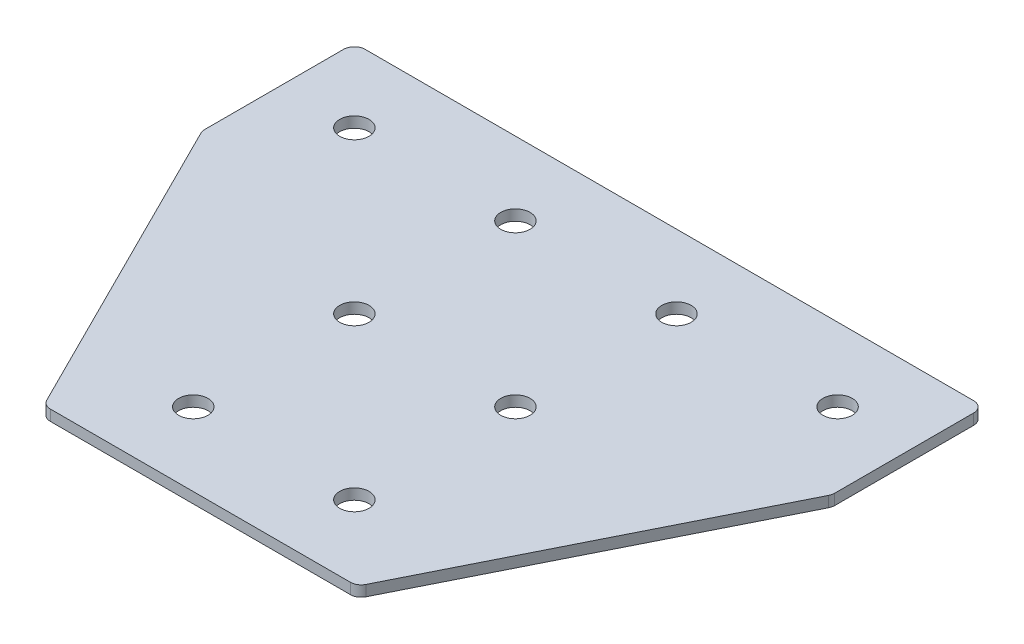
ISO-10303-21;
HEADER;
FILE_DESCRIPTION(('STEP AP214'),'2;1');
FILE_NAME('part.step','',(''),(''),'','','');
FILE_SCHEMA(('AUTOMOTIVE_DESIGN { 1 0 10303 214 1 1 1 1 }'));
ENDSEC;
DATA;
#1=APPLICATION_CONTEXT('core data for automotive mechanical design processes');
#2=APPLICATION_PROTOCOL_DEFINITION('international standard','automotive_design',2000,#1);
#3=PRODUCT_CONTEXT('',#1,'mechanical');
#4=PRODUCT('Part','Part','',(#3));
#5=PRODUCT_RELATED_PRODUCT_CATEGORY('part','',(#4));
#6=PRODUCT_DEFINITION_FORMATION('','',#4);
#7=PRODUCT_DEFINITION_CONTEXT('part definition',#1,'design');
#8=PRODUCT_DEFINITION('design','',#6,#7);
#9=PRODUCT_DEFINITION_SHAPE('','',#8);
#10=(LENGTH_UNIT() NAMED_UNIT(*) SI_UNIT(.MILLI.,.METRE.));
#11=(NAMED_UNIT(*) PLANE_ANGLE_UNIT() SI_UNIT($,.RADIAN.));
#12=(NAMED_UNIT(*) SI_UNIT($,.STERADIAN.) SOLID_ANGLE_UNIT());
#13=UNCERTAINTY_MEASURE_WITH_UNIT(LENGTH_MEASURE(1.E-05),#10,'distance_accuracy_value','');
#14=(GEOMETRIC_REPRESENTATION_CONTEXT(3) GLOBAL_UNCERTAINTY_ASSIGNED_CONTEXT((#13)) GLOBAL_UNIT_ASSIGNED_CONTEXT((#10,
#11,#12)) REPRESENTATION_CONTEXT('',''));
#15=CARTESIAN_POINT('',(0.,0.,0.));
#16=DIRECTION('',(0.,0.,1.));
#17=DIRECTION('',(1.,0.,0.));
#18=AXIS2_PLACEMENT_3D('',#15,#16,#17);
#19=CARTESIAN_POINT('',(-1.83641653643463,2.72446017824996,-47.3873571043964));
#20=DIRECTION('',(0.,-1.,0.));
#21=DIRECTION('',(0.,0.,-1.));
#22=AXIS2_PLACEMENT_3D('',#19,#20,#21);
#23=PLANE('',#22);
#24=DIRECTION('',(1.,0.,0.));
#25=VECTOR('',#24,1.);
#26=CARTESIAN_POINT('',(-44.8364165364347,2.72446017824996,63.1126428956036));
#27=LINE('',#26,#25);
#28=CARTESIAN_POINT('',(-43.7462465926852,2.72446017824996,63.1126428956036));
#29=VERTEX_POINT('',#28);
#30=CARTESIAN_POINT('',(40.073413519816,2.72446017824996,63.1126428956036));
#31=VERTEX_POINT('',#30);
#32=EDGE_CURVE('E194',#29,#31,#27,.T.);
#33=ORIENTED_EDGE('',*,*,#32,.F.);
#34=CARTESIAN_POINT('',(-43.7462465926852,2.72446017824996,60.1126428956036));
#35=DIRECTION('',(0.,1.,0.));
#36=DIRECTION('',(0.,0.,-1.));
#37=AXIS2_PLACEMENT_3D('',#34,#35,#36);
#38=CIRCLE('',#37,3.);
#39=CARTESIAN_POINT('',(-46.429528165685,2.72446017824996,61.4542836821035));
#40=VERTEX_POINT('',#39);
#41=EDGE_CURVE('E154',#40,#29,#38,.T.);
#42=ORIENTED_EDGE('',*,*,#41,.F.);
#43=DIRECTION('',(-0.447213595499957,0.,-0.894427190999917));
#44=VECTOR('',#43,1.);
#45=CARTESIAN_POINT('',(-45.6003485589349,2.72446017824996,63.1126428956036));
#46=LINE('',#45,#44);
#47=CARTESIAN_POINT('',(-89.5196981094343,2.72446017824996,-24.7260562053954));
#48=VERTEX_POINT('',#47);
#49=EDGE_CURVE('E141',#40,#48,#46,.T.);
#50=ORIENTED_EDGE('',*,*,#49,.T.);
#51=CARTESIAN_POINT('',(-86.8364165364345,2.72446017824996,-26.0676969918953));
#52=DIRECTION('',(0.,1.,0.));
#53=DIRECTION('',(0.,0.,-1.));
#54=AXIS2_PLACEMENT_3D('',#51,#52,#53);
#55=CIRCLE('',#54,3.);
#56=CARTESIAN_POINT('',(-89.8364165364345,2.72446017824996,-26.0676969918953));
#57=VERTEX_POINT('',#56);
#58=EDGE_CURVE('E152',#57,#48,#55,.T.);
#59=ORIENTED_EDGE('',*,*,#58,.F.);
#60=DIRECTION('',(0.,0.,-1.));
#61=VECTOR('',#60,1.);
#62=CARTESIAN_POINT('',(-89.8364165364345,2.72446017824996,-25.3594930593959));
#63=LINE('',#62,#61);
#64=CARTESIAN_POINT('',(-89.8364165364345,2.72446017824996,-64.8873571043964));
#65=VERTEX_POINT('',#64);
#66=EDGE_CURVE('E124',#57,#65,#63,.T.);
#67=ORIENTED_EDGE('',*,*,#66,.T.);
#68=CARTESIAN_POINT('',(-86.8364165364345,2.72446017824996,-64.8873571043964));
#69=DIRECTION('',(0.,1.,0.));
#70=DIRECTION('',(0.,0.,-1.));
#71=AXIS2_PLACEMENT_3D('',#68,#69,#70);
#72=CIRCLE('',#71,3.);
#73=CARTESIAN_POINT('',(-86.8364165364345,2.72446017824996,-67.8873571043964));
#74=VERTEX_POINT('',#73);
#75=EDGE_CURVE('E149',#74,#65,#72,.T.);
#76=ORIENTED_EDGE('',*,*,#75,.F.);
#77=DIRECTION('',(-1.,0.,0.));
#78=VECTOR('',#77,1.);
#79=CARTESIAN_POINT('',(86.1635834635653,2.72446017824996,-67.8873571043964));
#80=LINE('',#79,#78);
#81=CARTESIAN_POINT('',(83.1635834635653,2.72446017824996,-67.8873571043964));
#82=VERTEX_POINT('',#81);
#83=EDGE_CURVE('E191',#82,#74,#80,.T.);
#84=ORIENTED_EDGE('',*,*,#83,.F.);
#85=CARTESIAN_POINT('',(83.1635834635653,2.72446017824996,-64.8873571043964));
#86=DIRECTION('',(0.,-1.,0.));
#87=DIRECTION('',(0.,0.,-1.));
#88=AXIS2_PLACEMENT_3D('',#85,#86,#87);
#89=CIRCLE('',#88,3.);
#90=CARTESIAN_POINT('',(86.1635834635653,2.72446017824996,-64.8873571043964));
#91=VERTEX_POINT('',#90);
#92=EDGE_CURVE('E215',#82,#91,#89,.T.);
#93=ORIENTED_EDGE('',*,*,#92,.T.);
#94=DIRECTION('',(0.,0.,-1.));
#95=VECTOR('',#94,1.);
#96=CARTESIAN_POINT('',(86.1635834635653,2.72446017824996,-25.3594930593959));
#97=LINE('',#96,#95);
#98=CARTESIAN_POINT('',(86.1635834635653,2.72446017824996,-26.0676969918953));
#99=VERTEX_POINT('',#98);
#100=EDGE_CURVE('E188',#99,#91,#97,.T.);
#101=ORIENTED_EDGE('',*,*,#100,.F.);
#102=CARTESIAN_POINT('',(83.1635834635653,2.72446017824996,-26.0676969918953));
#103=DIRECTION('',(0.,-1.,0.));
#104=DIRECTION('',(0.,0.,-1.));
#105=AXIS2_PLACEMENT_3D('',#102,#103,#104);
#106=CIRCLE('',#105,3.);
#107=CARTESIAN_POINT('',(85.846865036565,2.72446017824996,-24.7260562053954));
#108=VERTEX_POINT('',#107);
#109=EDGE_CURVE('E31',#99,#108,#106,.T.);
#110=ORIENTED_EDGE('',*,*,#109,.T.);
#111=DIRECTION('',(0.447213595499957,0.,-0.894427190999917));
#112=VECTOR('',#111,1.);
#113=CARTESIAN_POINT('',(41.9275154860657,2.72446017824996,63.1126428956036));
#114=LINE('',#113,#112);
#115=CARTESIAN_POINT('',(42.7566950928157,2.72446017824996,61.4542836821035));
#116=VERTEX_POINT('',#115);
#117=EDGE_CURVE('E196',#116,#108,#114,.T.);
#118=ORIENTED_EDGE('',*,*,#117,.F.);
#119=CARTESIAN_POINT('',(40.073413519816,2.72446017824996,60.1126428956036));
#120=DIRECTION('',(0.,-1.,0.));
#121=DIRECTION('',(0.,0.,-1.));
#122=AXIS2_PLACEMENT_3D('',#119,#120,#121);
#123=CIRCLE('',#122,3.);
#124=EDGE_CURVE('E218',#116,#31,#123,.T.);
#125=ORIENTED_EDGE('',*,*,#124,.T.);
#126=EDGE_LOOP('',(#33,#42,#50,#59,#67,#76,#84,#93,#101,#110,#118,#125));
#127=FACE_BOUND('',#126,.T.);
#128=CARTESIAN_POINT('',(20.6635834635654,2.72446017824996,42.6126428956036));
#129=DIRECTION('',(0.,1.,0.));
#130=DIRECTION('',(0.,0.,1.));
#131=AXIS2_PLACEMENT_3D('',#128,#129,#130);
#132=CIRCLE('',#131,4.1);
#133=CARTESIAN_POINT('',(20.6635834635654,2.72446017824996,46.7126428956036));
#134=VERTEX_POINT('',#133);
#135=EDGE_CURVE('E164',#134,#134,#132,.T.);
#136=ORIENTED_EDGE('',*,*,#135,.T.);
#137=EDGE_LOOP('',(#136));
#138=FACE_BOUND('',#137,.T.);
#139=CARTESIAN_POINT('',(20.6635834635654,2.72446017824996,-2.38735710439639));
#140=DIRECTION('',(0.,1.,0.));
#141=DIRECTION('',(0.,0.,1.));
#142=AXIS2_PLACEMENT_3D('',#139,#140,#141);
#143=CIRCLE('',#142,4.1);
#144=CARTESIAN_POINT('',(20.6635834635654,2.72446017824996,1.71264289560361));
#145=VERTEX_POINT('',#144);
#146=EDGE_CURVE('E170',#145,#145,#143,.T.);
#147=ORIENTED_EDGE('',*,*,#146,.T.);
#148=EDGE_LOOP('',(#147));
#149=FACE_BOUND('',#148,.T.);
#150=CARTESIAN_POINT('',(65.6635834635654,2.72446017824996,-47.3873571043964));
#151=DIRECTION('',(0.,1.,0.));
#152=DIRECTION('',(0.,0.,1.));
#153=AXIS2_PLACEMENT_3D('',#150,#151,#152);
#154=CIRCLE('',#153,4.09999999999999);
#155=CARTESIAN_POINT('',(65.6635834635654,2.72446017824996,-43.2873571043964));
#156=VERTEX_POINT('',#155);
#157=EDGE_CURVE('E176',#156,#156,#154,.T.);
#158=ORIENTED_EDGE('',*,*,#157,.T.);
#159=EDGE_LOOP('',(#158));
#160=FACE_BOUND('',#159,.T.);
#161=CARTESIAN_POINT('',(20.6635834635654,2.72446017824996,-47.3873571043964));
#162=DIRECTION('',(0.,1.,0.));
#163=DIRECTION('',(0.,0.,1.));
#164=AXIS2_PLACEMENT_3D('',#161,#162,#163);
#165=CIRCLE('',#164,4.1);
#166=CARTESIAN_POINT('',(20.6635834635654,2.72446017824996,-43.2873571043964));
#167=VERTEX_POINT('',#166);
#168=EDGE_CURVE('E182',#167,#167,#165,.T.);
#169=ORIENTED_EDGE('',*,*,#168,.T.);
#170=EDGE_LOOP('',(#169));
#171=FACE_BOUND('',#170,.T.);
#172=CARTESIAN_POINT('',(-24.3364165364346,2.72446017824996,42.6126428956036));
#173=DIRECTION('',(0.,-1.,0.));
#174=DIRECTION('',(0.,0.,1.));
#175=AXIS2_PLACEMENT_3D('',#172,#173,#174);
#176=CIRCLE('',#175,4.1);
#177=CARTESIAN_POINT('',(-24.3364165364346,2.72446017824996,46.7126428956036));
#178=VERTEX_POINT('',#177);
#179=EDGE_CURVE('E270',#178,#178,#176,.T.);
#180=ORIENTED_EDGE('',*,*,#179,.F.);
#181=EDGE_LOOP('',(#180));
#182=FACE_BOUND('',#181,.T.);
#183=CARTESIAN_POINT('',(-24.3364165364346,2.72446017824996,-2.38735710439638));
#184=DIRECTION('',(0.,-1.,0.));
#185=DIRECTION('',(0.,0.,1.));
#186=AXIS2_PLACEMENT_3D('',#183,#184,#185);
#187=CIRCLE('',#186,4.1);
#188=CARTESIAN_POINT('',(-24.3364165364346,2.72446017824996,1.71264289560362));
#189=VERTEX_POINT('',#188);
#190=EDGE_CURVE('E264',#189,#189,#187,.T.);
#191=ORIENTED_EDGE('',*,*,#190,.F.);
#192=EDGE_LOOP('',(#191));
#193=FACE_BOUND('',#192,.T.);
#194=CARTESIAN_POINT('',(-69.3364165364346,2.72446017824996,-47.3873571043964));
#195=DIRECTION('',(0.,-1.,0.));
#196=DIRECTION('',(0.,0.,1.));
#197=AXIS2_PLACEMENT_3D('',#194,#195,#196);
#198=CIRCLE('',#197,4.09999999999999);
#199=CARTESIAN_POINT('',(-69.3364165364346,2.72446017824996,-43.2873571043964));
#200=VERTEX_POINT('',#199);
#201=EDGE_CURVE('E259',#200,#200,#198,.T.);
#202=ORIENTED_EDGE('',*,*,#201,.F.);
#203=EDGE_LOOP('',(#202));
#204=FACE_BOUND('',#203,.T.);
#205=CARTESIAN_POINT('',(-24.3364165364346,2.72446017824996,-47.3873571043964));
#206=DIRECTION('',(0.,-1.,0.));
#207=DIRECTION('',(0.,0.,1.));
#208=AXIS2_PLACEMENT_3D('',#205,#206,#207);
#209=CIRCLE('',#208,4.1);
#210=CARTESIAN_POINT('',(-24.3364165364346,2.72446017824996,-43.2873571043964));
#211=VERTEX_POINT('',#210);
#212=EDGE_CURVE('E134',#211,#211,#209,.T.);
#213=ORIENTED_EDGE('',*,*,#212,.F.);
#214=EDGE_LOOP('',(#213));
#215=FACE_BOUND('',#214,.T.);
#216=ADVANCED_FACE('F16',(#127,#138,#149,#160,#171,#182,#193,#204,#215),#23,.T.);
#217=CARTESIAN_POINT('',(86.1635834635653,2.72446017824996,-25.3594930593959));
#218=DIRECTION('',(1.,0.,0.));
#219=DIRECTION('',(0.,0.,-1.));
#220=AXIS2_PLACEMENT_3D('',#217,#218,#219);
#221=PLANE('',#220);
#222=DIRECTION('',(0.,0.,-1.));
#223=VECTOR('',#222,1.);
#224=CARTESIAN_POINT('',(86.1635834635653,5.72446017824996,-25.3594930593959));
#225=LINE('',#224,#223);
#226=CARTESIAN_POINT('',(86.1635834635653,5.72446017824996,-26.0676969918953));
#227=VERTEX_POINT('',#226);
#228=CARTESIAN_POINT('',(86.1635834635653,5.72446017824996,-64.8873571043964));
#229=VERTEX_POINT('',#228);
#230=EDGE_CURVE('E185',#227,#229,#225,.T.);
#231=ORIENTED_EDGE('',*,*,#230,.F.);
#232=DIRECTION('',(0.,1.,0.));
#233=VECTOR('',#232,1.);
#234=CARTESIAN_POINT('',(86.1635834635653,2.72446017824996,-26.0676969918953));
#235=LINE('',#234,#233);
#236=EDGE_CURVE('E24',#227,#99,#235,.F.);
#237=ORIENTED_EDGE('',*,*,#236,.T.);
#238=ORIENTED_EDGE('',*,*,#100,.T.);
#239=DIRECTION('',(0.,1.,0.));
#240=VECTOR('',#239,1.);
#241=CARTESIAN_POINT('',(86.1635834635653,2.72446017824996,-64.8873571043964));
#242=LINE('',#241,#240);
#243=EDGE_CURVE('E225',#91,#229,#242,.T.);
#244=ORIENTED_EDGE('',*,*,#243,.T.);
#245=EDGE_LOOP('',(#231,#237,#238,#244));
#246=FACE_BOUND('',#245,.T.);
#247=ADVANCED_FACE('F230',(#246),#221,.T.);
#248=CARTESIAN_POINT('',(41.9275154860657,2.72446017824996,63.1126428956036));
#249=DIRECTION('',(0.894427190999917,0.,0.447213595499957));
#250=DIRECTION('',(0.447213595499957,0.,-0.894427190999917));
#251=AXIS2_PLACEMENT_3D('',#248,#249,#250);
#252=PLANE('',#251);
#253=DIRECTION('',(0.447213595499957,0.,-0.894427190999917));
#254=VECTOR('',#253,1.);
#255=CARTESIAN_POINT('',(41.9275154860657,5.72446017824996,63.1126428956036));
#256=LINE('',#255,#254);
#257=CARTESIAN_POINT('',(42.7566950928157,5.72446017824996,61.4542836821035));
#258=VERTEX_POINT('',#257);
#259=CARTESIAN_POINT('',(85.846865036565,5.72446017824996,-24.7260562053954));
#260=VERTEX_POINT('',#259);
#261=EDGE_CURVE('E192',#258,#260,#256,.T.);
#262=ORIENTED_EDGE('',*,*,#261,.F.);
#263=DIRECTION('',(0.,1.,0.));
#264=VECTOR('',#263,1.);
#265=CARTESIAN_POINT('',(42.7566950928157,2.72446017824996,61.4542836821035));
#266=LINE('',#265,#264);
#267=EDGE_CURVE('E38',#258,#116,#266,.F.);
#268=ORIENTED_EDGE('',*,*,#267,.T.);
#269=ORIENTED_EDGE('',*,*,#117,.T.);
#270=DIRECTION('',(0.,1.,0.));
#271=VECTOR('',#270,1.);
#272=CARTESIAN_POINT('',(85.846865036565,2.72446017824996,-24.7260562053954));
#273=LINE('',#272,#271);
#274=EDGE_CURVE('E221',#108,#260,#273,.T.);
#275=ORIENTED_EDGE('',*,*,#274,.T.);
#276=EDGE_LOOP('',(#262,#268,#269,#275));
#277=FACE_BOUND('',#276,.T.);
#278=ADVANCED_FACE('F238',(#277),#252,.T.);
#279=CARTESIAN_POINT('',(-44.8364165364347,2.72446017824996,63.1126428956036));
#280=DIRECTION('',(0.,0.,1.));
#281=DIRECTION('',(1.,0.,0.));
#282=AXIS2_PLACEMENT_3D('',#279,#280,#281);
#283=PLANE('',#282);
#284=DIRECTION('',(1.,0.,0.));
#285=VECTOR('',#284,1.);
#286=CARTESIAN_POINT('',(-44.8364165364347,5.72446017824996,63.1126428956036));
#287=LINE('',#286,#285);
#288=CARTESIAN_POINT('',(-43.7462465926852,5.72446017824996,63.1126428956036));
#289=VERTEX_POINT('',#288);
#290=CARTESIAN_POINT('',(40.073413519816,5.72446017824996,63.1126428956036));
#291=VERTEX_POINT('',#290);
#292=EDGE_CURVE('E203',#289,#291,#287,.T.);
#293=ORIENTED_EDGE('',*,*,#292,.F.);
#294=DIRECTION('',(0.,1.,0.));
#295=VECTOR('',#294,1.);
#296=CARTESIAN_POINT('',(-43.7462465926852,2.72446017824996,63.1126428956036));
#297=LINE('',#296,#295);
#298=EDGE_CURVE('E146',#29,#289,#297,.T.);
#299=ORIENTED_EDGE('',*,*,#298,.F.);
#300=ORIENTED_EDGE('',*,*,#32,.T.);
#301=DIRECTION('',(0.,1.,0.));
#302=VECTOR('',#301,1.);
#303=CARTESIAN_POINT('',(40.073413519816,2.72446017824996,63.1126428956036));
#304=LINE('',#303,#302);
#305=EDGE_CURVE('E212',#31,#291,#304,.T.);
#306=ORIENTED_EDGE('',*,*,#305,.T.);
#307=EDGE_LOOP('',(#293,#299,#300,#306));
#308=FACE_BOUND('',#307,.T.);
#309=ADVANCED_FACE('F246',(#308),#283,.T.);
#310=CARTESIAN_POINT('',(86.1635834635653,2.72446017824996,-67.8873571043964));
#311=DIRECTION('',(0.,0.,-1.));
#312=DIRECTION('',(-1.,0.,0.));
#313=AXIS2_PLACEMENT_3D('',#310,#311,#312);
#314=PLANE('',#313);
#315=ORIENTED_EDGE('',*,*,#83,.T.);
#316=DIRECTION('',(0.,1.,0.));
#317=VECTOR('',#316,1.);
#318=CARTESIAN_POINT('',(-86.8364165364345,2.72446017824996,-67.8873571043964));
#319=LINE('',#318,#317);
#320=CARTESIAN_POINT('',(-86.8364165364345,5.72446017824996,-67.8873571043964));
#321=VERTEX_POINT('',#320);
#322=EDGE_CURVE('E126',#321,#74,#319,.F.);
#323=ORIENTED_EDGE('',*,*,#322,.F.);
#324=DIRECTION('',(-1.,0.,0.));
#325=VECTOR('',#324,1.);
#326=CARTESIAN_POINT('',(86.1635834635653,5.72446017824996,-67.8873571043964));
#327=LINE('',#326,#325);
#328=CARTESIAN_POINT('',(83.1635834635653,5.72446017824996,-67.8873571043964));
#329=VERTEX_POINT('',#328);
#330=EDGE_CURVE('E201',#329,#321,#327,.T.);
#331=ORIENTED_EDGE('',*,*,#330,.F.);
#332=DIRECTION('',(0.,1.,0.));
#333=VECTOR('',#332,1.);
#334=CARTESIAN_POINT('',(83.1635834635653,2.72446017824996,-67.8873571043964));
#335=LINE('',#334,#333);
#336=EDGE_CURVE('E10',#329,#82,#335,.F.);
#337=ORIENTED_EDGE('',*,*,#336,.T.);
#338=EDGE_LOOP('',(#315,#323,#331,#337));
#339=FACE_BOUND('',#338,.T.);
#340=ADVANCED_FACE('F300',(#339),#314,.T.);
#341=CARTESIAN_POINT('',(-1.83641653643463,5.72446017824996,-47.3873571043964));
#342=DIRECTION('',(0.,-1.,0.));
#343=DIRECTION('',(0.,0.,-1.));
#344=AXIS2_PLACEMENT_3D('',#341,#342,#343);
#345=PLANE('',#344);
#346=CARTESIAN_POINT('',(20.6635834635654,5.72446017824996,42.6126428956036));
#347=DIRECTION('',(0.,1.,0.));
#348=DIRECTION('',(0.,0.,1.));
#349=AXIS2_PLACEMENT_3D('',#346,#347,#348);
#350=CIRCLE('',#349,4.1);
#351=CARTESIAN_POINT('',(20.6635834635654,5.72446017824996,46.7126428956036));
#352=VERTEX_POINT('',#351);
#353=EDGE_CURVE('E163',#352,#352,#350,.T.);
#354=ORIENTED_EDGE('',*,*,#353,.F.);
#355=EDGE_LOOP('',(#354));
#356=FACE_BOUND('',#355,.T.);
#357=CARTESIAN_POINT('',(20.6635834635654,5.72446017824996,-2.38735710439639));
#358=DIRECTION('',(0.,1.,0.));
#359=DIRECTION('',(0.,0.,1.));
#360=AXIS2_PLACEMENT_3D('',#357,#358,#359);
#361=CIRCLE('',#360,4.1);
#362=CARTESIAN_POINT('',(20.6635834635654,5.72446017824996,1.71264289560361));
#363=VERTEX_POINT('',#362);
#364=EDGE_CURVE('E167',#363,#363,#361,.T.);
#365=ORIENTED_EDGE('',*,*,#364,.F.);
#366=EDGE_LOOP('',(#365));
#367=FACE_BOUND('',#366,.T.);
#368=CARTESIAN_POINT('',(65.6635834635654,5.72446017824996,-47.3873571043964));
#369=DIRECTION('',(0.,1.,0.));
#370=DIRECTION('',(0.,0.,1.));
#371=AXIS2_PLACEMENT_3D('',#368,#369,#370);
#372=CIRCLE('',#371,4.09999999999999);
#373=CARTESIAN_POINT('',(65.6635834635654,5.72446017824996,-43.2873571043964));
#374=VERTEX_POINT('',#373);
#375=EDGE_CURVE('E173',#374,#374,#372,.T.);
#376=ORIENTED_EDGE('',*,*,#375,.F.);
#377=EDGE_LOOP('',(#376));
#378=FACE_BOUND('',#377,.T.);
#379=CARTESIAN_POINT('',(20.6635834635654,5.72446017824996,-47.3873571043964));
#380=DIRECTION('',(0.,1.,0.));
#381=DIRECTION('',(0.,0.,1.));
#382=AXIS2_PLACEMENT_3D('',#379,#380,#381);
#383=CIRCLE('',#382,4.1);
#384=CARTESIAN_POINT('',(20.6635834635654,5.72446017824996,-43.2873571043964));
#385=VERTEX_POINT('',#384);
#386=EDGE_CURVE('E179',#385,#385,#383,.T.);
#387=ORIENTED_EDGE('',*,*,#386,.F.);
#388=EDGE_LOOP('',(#387));
#389=FACE_BOUND('',#388,.T.);
#390=ORIENTED_EDGE('',*,*,#330,.T.);
#391=CARTESIAN_POINT('',(-86.8364165364345,5.72446017824996,-64.8873571043964));
#392=DIRECTION('',(0.,1.,0.));
#393=DIRECTION('',(0.,0.,-1.));
#394=AXIS2_PLACEMENT_3D('',#391,#392,#393);
#395=CIRCLE('',#394,3.);
#396=CARTESIAN_POINT('',(-89.8364165364345,5.72446017824996,-64.8873571043964));
#397=VERTEX_POINT('',#396);
#398=EDGE_CURVE('E117',#397,#321,#395,.F.);
#399=ORIENTED_EDGE('',*,*,#398,.F.);
#400=DIRECTION('',(0.,0.,-1.));
#401=VECTOR('',#400,1.);
#402=CARTESIAN_POINT('',(-89.8364165364345,5.72446017824996,-25.3594930593959));
#403=LINE('',#402,#401);
#404=CARTESIAN_POINT('',(-89.8364165364345,5.72446017824996,-26.0676969918953));
#405=VERTEX_POINT('',#404);
#406=EDGE_CURVE('E122',#405,#397,#403,.T.);
#407=ORIENTED_EDGE('',*,*,#406,.F.);
#408=CARTESIAN_POINT('',(-86.8364165364345,5.72446017824996,-26.0676969918953));
#409=DIRECTION('',(0.,1.,0.));
#410=DIRECTION('',(0.,0.,-1.));
#411=AXIS2_PLACEMENT_3D('',#408,#409,#410);
#412=CIRCLE('',#411,3.);
#413=CARTESIAN_POINT('',(-89.5196981094343,5.72446017824996,-24.7260562053954));
#414=VERTEX_POINT('',#413);
#415=EDGE_CURVE('E105',#414,#405,#412,.F.);
#416=ORIENTED_EDGE('',*,*,#415,.F.);
#417=DIRECTION('',(-0.447213595499957,0.,-0.894427190999917));
#418=VECTOR('',#417,1.);
#419=CARTESIAN_POINT('',(-45.6003485589349,5.72446017824996,63.1126428956036));
#420=LINE('',#419,#418);
#421=CARTESIAN_POINT('',(-46.429528165685,5.72446017824996,61.4542836821035));
#422=VERTEX_POINT('',#421);
#423=EDGE_CURVE('E133',#422,#414,#420,.T.);
#424=ORIENTED_EDGE('',*,*,#423,.F.);
#425=CARTESIAN_POINT('',(-43.7462465926852,5.72446017824996,60.1126428956036));
#426=DIRECTION('',(0.,1.,0.));
#427=DIRECTION('',(0.,0.,-1.));
#428=AXIS2_PLACEMENT_3D('',#425,#426,#427);
#429=CIRCLE('',#428,3.);
#430=EDGE_CURVE('E116',#289,#422,#429,.F.);
#431=ORIENTED_EDGE('',*,*,#430,.F.);
#432=ORIENTED_EDGE('',*,*,#292,.T.);
#433=CARTESIAN_POINT('',(40.073413519816,5.72446017824996,60.1126428956036));
#434=DIRECTION('',(0.,-1.,0.));
#435=DIRECTION('',(0.,0.,-1.));
#436=AXIS2_PLACEMENT_3D('',#433,#434,#435);
#437=CIRCLE('',#436,3.);
#438=EDGE_CURVE('E210',#291,#258,#437,.F.);
#439=ORIENTED_EDGE('',*,*,#438,.T.);
#440=ORIENTED_EDGE('',*,*,#261,.T.);
#441=CARTESIAN_POINT('',(83.1635834635653,5.72446017824996,-26.0676969918953));
#442=DIRECTION('',(0.,-1.,0.));
#443=DIRECTION('',(0.,0.,-1.));
#444=AXIS2_PLACEMENT_3D('',#441,#442,#443);
#445=CIRCLE('',#444,3.);
#446=EDGE_CURVE('E208',#260,#227,#445,.F.);
#447=ORIENTED_EDGE('',*,*,#446,.T.);
#448=ORIENTED_EDGE('',*,*,#230,.T.);
#449=CARTESIAN_POINT('',(83.1635834635653,5.72446017824996,-64.8873571043964));
#450=DIRECTION('',(0.,-1.,0.));
#451=DIRECTION('',(0.,0.,-1.));
#452=AXIS2_PLACEMENT_3D('',#449,#450,#451);
#453=CIRCLE('',#452,3.);
#454=EDGE_CURVE('E198',#229,#329,#453,.F.);
#455=ORIENTED_EDGE('',*,*,#454,.T.);
#456=EDGE_LOOP('',(#390,#399,#407,#416,#424,#431,#432,#439,#440,#447,#448,#455));
#457=FACE_BOUND('',#456,.T.);
#458=CARTESIAN_POINT('',(-24.3364165364346,5.72446017824996,42.6126428956036));
#459=DIRECTION('',(0.,-1.,0.));
#460=DIRECTION('',(0.,0.,1.));
#461=AXIS2_PLACEMENT_3D('',#458,#459,#460);
#462=CIRCLE('',#461,4.1);
#463=CARTESIAN_POINT('',(-24.3364165364346,5.72446017824996,46.7126428956036));
#464=VERTEX_POINT('',#463);
#465=EDGE_CURVE('E273',#464,#464,#462,.T.);
#466=ORIENTED_EDGE('',*,*,#465,.T.);
#467=EDGE_LOOP('',(#466));
#468=FACE_BOUND('',#467,.T.);
#469=CARTESIAN_POINT('',(-24.3364165364346,5.72446017824996,-2.38735710439638));
#470=DIRECTION('',(0.,-1.,0.));
#471=DIRECTION('',(0.,0.,1.));
#472=AXIS2_PLACEMENT_3D('',#469,#470,#471);
#473=CIRCLE('',#472,4.1);
#474=CARTESIAN_POINT('',(-24.3364165364346,5.72446017824996,1.71264289560362));
#475=VERTEX_POINT('',#474);
#476=EDGE_CURVE('E267',#475,#475,#473,.T.);
#477=ORIENTED_EDGE('',*,*,#476,.T.);
#478=EDGE_LOOP('',(#477));
#479=FACE_BOUND('',#478,.T.);
#480=CARTESIAN_POINT('',(-69.3364165364346,5.72446017824996,-47.3873571043964));
#481=DIRECTION('',(0.,-1.,0.));
#482=DIRECTION('',(0.,0.,1.));
#483=AXIS2_PLACEMENT_3D('',#480,#481,#482);
#484=CIRCLE('',#483,4.09999999999999);
#485=CARTESIAN_POINT('',(-69.3364165364346,5.72446017824996,-43.2873571043964));
#486=VERTEX_POINT('',#485);
#487=EDGE_CURVE('E261',#486,#486,#484,.T.);
#488=ORIENTED_EDGE('',*,*,#487,.T.);
#489=EDGE_LOOP('',(#488));
#490=FACE_BOUND('',#489,.T.);
#491=CARTESIAN_POINT('',(-24.3364165364346,5.72446017824996,-47.3873571043964));
#492=DIRECTION('',(0.,-1.,0.));
#493=DIRECTION('',(0.,0.,1.));
#494=AXIS2_PLACEMENT_3D('',#491,#492,#493);
#495=CIRCLE('',#494,4.1);
#496=CARTESIAN_POINT('',(-24.3364165364346,5.72446017824996,-43.2873571043964));
#497=VERTEX_POINT('',#496);
#498=EDGE_CURVE('E138',#497,#497,#495,.T.);
#499=ORIENTED_EDGE('',*,*,#498,.T.);
#500=EDGE_LOOP('',(#499));
#501=FACE_BOUND('',#500,.T.);
#502=ADVANCED_FACE('F129',(#356,#367,#378,#389,#457,#468,#479,#490,#501),#345,.F.);
#503=CARTESIAN_POINT('',(40.073413519816,2.72446017824996,60.1126428956036));
#504=DIRECTION('',(0.,1.,0.));
#505=DIRECTION('',(0.,0.,1.));
#506=AXIS2_PLACEMENT_3D('',#503,#504,#505);
#507=CYLINDRICAL_SURFACE('',#506,3.);
#508=ORIENTED_EDGE('',*,*,#124,.F.);
#509=ORIENTED_EDGE('',*,*,#267,.F.);
#510=ORIENTED_EDGE('',*,*,#438,.F.);
#511=ORIENTED_EDGE('',*,*,#305,.F.);
#512=EDGE_LOOP('',(#508,#509,#510,#511));
#513=FACE_BOUND('',#512,.T.);
#514=ADVANCED_FACE('F244',(#513),#507,.T.);
#515=CARTESIAN_POINT('',(83.1635834635653,2.72446017824996,-26.0676969918953));
#516=DIRECTION('',(0.,1.,0.));
#517=DIRECTION('',(0.,0.,1.));
#518=AXIS2_PLACEMENT_3D('',#515,#516,#517);
#519=CYLINDRICAL_SURFACE('',#518,3.);
#520=ORIENTED_EDGE('',*,*,#109,.F.);
#521=ORIENTED_EDGE('',*,*,#236,.F.);
#522=ORIENTED_EDGE('',*,*,#446,.F.);
#523=ORIENTED_EDGE('',*,*,#274,.F.);
#524=EDGE_LOOP('',(#520,#521,#522,#523));
#525=FACE_BOUND('',#524,.T.);
#526=ADVANCED_FACE('F237',(#525),#519,.T.);
#527=CARTESIAN_POINT('',(83.1635834635653,2.72446017824996,-64.8873571043964));
#528=DIRECTION('',(0.,1.,0.));
#529=DIRECTION('',(0.,0.,1.));
#530=AXIS2_PLACEMENT_3D('',#527,#528,#529);
#531=CYLINDRICAL_SURFACE('',#530,3.);
#532=ORIENTED_EDGE('',*,*,#92,.F.);
#533=ORIENTED_EDGE('',*,*,#336,.F.);
#534=ORIENTED_EDGE('',*,*,#454,.F.);
#535=ORIENTED_EDGE('',*,*,#243,.F.);
#536=EDGE_LOOP('',(#532,#533,#534,#535));
#537=FACE_BOUND('',#536,.T.);
#538=ADVANCED_FACE('F18',(#537),#531,.T.);
#539=CARTESIAN_POINT('',(20.6635834635654,2.72446017824996,-47.3873571043964));
#540=DIRECTION('',(0.,1.,0.));
#541=DIRECTION('',(0.,0.,1.));
#542=AXIS2_PLACEMENT_3D('',#539,#540,#541);
#543=CYLINDRICAL_SURFACE('',#542,4.1);
#544=ORIENTED_EDGE('',*,*,#168,.F.);
#545=EDGE_LOOP('',(#544));
#546=FACE_BOUND('',#545,.T.);
#547=ORIENTED_EDGE('',*,*,#386,.T.);
#548=EDGE_LOOP('',(#547));
#549=FACE_BOUND('',#548,.T.);
#550=ADVANCED_FACE('F318',(#546,#549),#543,.F.);
#551=CARTESIAN_POINT('',(65.6635834635654,2.72446017824996,-47.3873571043964));
#552=DIRECTION('',(0.,1.,0.));
#553=DIRECTION('',(0.,0.,1.));
#554=AXIS2_PLACEMENT_3D('',#551,#552,#553);
#555=CYLINDRICAL_SURFACE('',#554,4.09999999999999);
#556=ORIENTED_EDGE('',*,*,#157,.F.);
#557=EDGE_LOOP('',(#556));
#558=FACE_BOUND('',#557,.T.);
#559=ORIENTED_EDGE('',*,*,#375,.T.);
#560=EDGE_LOOP('',(#559));
#561=FACE_BOUND('',#560,.T.);
#562=ADVANCED_FACE('F323',(#558,#561),#555,.F.);
#563=CARTESIAN_POINT('',(20.6635834635654,2.72446017824996,-2.38735710439639));
#564=DIRECTION('',(0.,1.,0.));
#565=DIRECTION('',(0.,0.,1.));
#566=AXIS2_PLACEMENT_3D('',#563,#564,#565);
#567=CYLINDRICAL_SURFACE('',#566,4.1);
#568=ORIENTED_EDGE('',*,*,#146,.F.);
#569=EDGE_LOOP('',(#568));
#570=FACE_BOUND('',#569,.T.);
#571=ORIENTED_EDGE('',*,*,#364,.T.);
#572=EDGE_LOOP('',(#571));
#573=FACE_BOUND('',#572,.T.);
#574=ADVANCED_FACE('F341',(#570,#573),#567,.F.);
#575=CARTESIAN_POINT('',(20.6635834635654,2.72446017824996,42.6126428956036));
#576=DIRECTION('',(0.,1.,0.));
#577=DIRECTION('',(0.,0.,1.));
#578=AXIS2_PLACEMENT_3D('',#575,#576,#577);
#579=CYLINDRICAL_SURFACE('',#578,4.1);
#580=ORIENTED_EDGE('',*,*,#135,.F.);
#581=EDGE_LOOP('',(#580));
#582=FACE_BOUND('',#581,.T.);
#583=ORIENTED_EDGE('',*,*,#353,.T.);
#584=EDGE_LOOP('',(#583));
#585=FACE_BOUND('',#584,.T.);
#586=ADVANCED_FACE('F338',(#582,#585),#579,.F.);
#587=CARTESIAN_POINT('',(-89.8364165364345,2.72446017824996,-25.3594930593959));
#588=DIRECTION('',(-1.,0.,0.));
#589=DIRECTION('',(0.,0.,-1.));
#590=AXIS2_PLACEMENT_3D('',#587,#588,#589);
#591=PLANE('',#590);
#592=ORIENTED_EDGE('',*,*,#406,.T.);
#593=DIRECTION('',(0.,1.,0.));
#594=VECTOR('',#593,1.);
#595=CARTESIAN_POINT('',(-89.8364165364345,2.72446017824996,-64.8873571043964));
#596=LINE('',#595,#594);
#597=EDGE_CURVE('E127',#65,#397,#596,.T.);
#598=ORIENTED_EDGE('',*,*,#597,.F.);
#599=ORIENTED_EDGE('',*,*,#66,.F.);
#600=DIRECTION('',(0.,1.,0.));
#601=VECTOR('',#600,1.);
#602=CARTESIAN_POINT('',(-89.8364165364345,2.72446017824996,-26.0676969918953));
#603=LINE('',#602,#601);
#604=EDGE_CURVE('E109',#405,#57,#603,.F.);
#605=ORIENTED_EDGE('',*,*,#604,.F.);
#606=EDGE_LOOP('',(#592,#598,#599,#605));
#607=FACE_BOUND('',#606,.T.);
#608=ADVANCED_FACE('F121',(#607),#591,.T.);
#609=CARTESIAN_POINT('',(-45.6003485589349,2.72446017824996,63.1126428956036));
#610=DIRECTION('',(-0.894427190999916,0.,0.447213595499957));
#611=DIRECTION('',(-0.447213595499957,0.,-0.894427190999916));
#612=AXIS2_PLACEMENT_3D('',#609,#610,#611);
#613=PLANE('',#612);
#614=ORIENTED_EDGE('',*,*,#423,.T.);
#615=DIRECTION('',(0.,1.,0.));
#616=VECTOR('',#615,1.);
#617=CARTESIAN_POINT('',(-89.5196981094343,2.72446017824996,-24.7260562053954));
#618=LINE('',#617,#616);
#619=EDGE_CURVE('E111',#48,#414,#618,.T.);
#620=ORIENTED_EDGE('',*,*,#619,.F.);
#621=ORIENTED_EDGE('',*,*,#49,.F.);
#622=DIRECTION('',(0.,1.,0.));
#623=VECTOR('',#622,1.);
#624=CARTESIAN_POINT('',(-46.429528165685,2.72446017824996,61.4542836821035));
#625=LINE('',#624,#623);
#626=EDGE_CURVE('E158',#422,#40,#625,.F.);
#627=ORIENTED_EDGE('',*,*,#626,.F.);
#628=EDGE_LOOP('',(#614,#620,#621,#627));
#629=FACE_BOUND('',#628,.T.);
#630=ADVANCED_FACE('F255',(#629),#613,.T.);
#631=CARTESIAN_POINT('',(-43.7462465926852,2.72446017824996,60.1126428956036));
#632=DIRECTION('',(0.,1.,0.));
#633=DIRECTION('',(0.,0.,1.));
#634=AXIS2_PLACEMENT_3D('',#631,#632,#633);
#635=CYLINDRICAL_SURFACE('',#634,3.);
#636=ORIENTED_EDGE('',*,*,#41,.T.);
#637=ORIENTED_EDGE('',*,*,#298,.T.);
#638=ORIENTED_EDGE('',*,*,#430,.T.);
#639=ORIENTED_EDGE('',*,*,#626,.T.);
#640=EDGE_LOOP('',(#636,#637,#638,#639));
#641=FACE_BOUND('',#640,.T.);
#642=ADVANCED_FACE('F252',(#641),#635,.T.);
#643=CARTESIAN_POINT('',(-86.8364165364345,2.72446017824996,-26.0676969918953));
#644=DIRECTION('',(0.,1.,0.));
#645=DIRECTION('',(0.,0.,1.));
#646=AXIS2_PLACEMENT_3D('',#643,#644,#645);
#647=CYLINDRICAL_SURFACE('',#646,3.);
#648=ORIENTED_EDGE('',*,*,#58,.T.);
#649=ORIENTED_EDGE('',*,*,#619,.T.);
#650=ORIENTED_EDGE('',*,*,#415,.T.);
#651=ORIENTED_EDGE('',*,*,#604,.T.);
#652=EDGE_LOOP('',(#648,#649,#650,#651));
#653=FACE_BOUND('',#652,.T.);
#654=ADVANCED_FACE('F108',(#653),#647,.T.);
#655=CARTESIAN_POINT('',(-86.8364165364345,2.72446017824996,-64.8873571043964));
#656=DIRECTION('',(0.,1.,0.));
#657=DIRECTION('',(0.,0.,1.));
#658=AXIS2_PLACEMENT_3D('',#655,#656,#657);
#659=CYLINDRICAL_SURFACE('',#658,3.);
#660=ORIENTED_EDGE('',*,*,#75,.T.);
#661=ORIENTED_EDGE('',*,*,#597,.T.);
#662=ORIENTED_EDGE('',*,*,#398,.T.);
#663=ORIENTED_EDGE('',*,*,#322,.T.);
#664=EDGE_LOOP('',(#660,#661,#662,#663));
#665=FACE_BOUND('',#664,.T.);
#666=ADVANCED_FACE('F295',(#665),#659,.T.);
#667=CARTESIAN_POINT('',(-24.3364165364346,2.72446017824996,-47.3873571043964));
#668=DIRECTION('',(0.,1.,0.));
#669=DIRECTION('',(0.,0.,1.));
#670=AXIS2_PLACEMENT_3D('',#667,#668,#669);
#671=CYLINDRICAL_SURFACE('',#670,4.1);
#672=ORIENTED_EDGE('',*,*,#212,.T.);
#673=EDGE_LOOP('',(#672));
#674=FACE_BOUND('',#673,.T.);
#675=ORIENTED_EDGE('',*,*,#498,.F.);
#676=EDGE_LOOP('',(#675));
#677=FACE_BOUND('',#676,.T.);
#678=ADVANCED_FACE('F291',(#674,#677),#671,.F.);
#679=CARTESIAN_POINT('',(-69.3364165364346,2.72446017824996,-47.3873571043964));
#680=DIRECTION('',(0.,1.,0.));
#681=DIRECTION('',(0.,0.,1.));
#682=AXIS2_PLACEMENT_3D('',#679,#680,#681);
#683=CYLINDRICAL_SURFACE('',#682,4.09999999999999);
#684=ORIENTED_EDGE('',*,*,#201,.T.);
#685=EDGE_LOOP('',(#684));
#686=FACE_BOUND('',#685,.T.);
#687=ORIENTED_EDGE('',*,*,#487,.F.);
#688=EDGE_LOOP('',(#687));
#689=FACE_BOUND('',#688,.T.);
#690=ADVANCED_FACE('F294',(#686,#689),#683,.F.);
#691=CARTESIAN_POINT('',(-24.3364165364346,2.72446017824996,-2.38735710439638));
#692=DIRECTION('',(0.,1.,0.));
#693=DIRECTION('',(0.,0.,1.));
#694=AXIS2_PLACEMENT_3D('',#691,#692,#693);
#695=CYLINDRICAL_SURFACE('',#694,4.1);
#696=ORIENTED_EDGE('',*,*,#190,.T.);
#697=EDGE_LOOP('',(#696));
#698=FACE_BOUND('',#697,.T.);
#699=ORIENTED_EDGE('',*,*,#476,.F.);
#700=EDGE_LOOP('',(#699));
#701=FACE_BOUND('',#700,.T.);
#702=ADVANCED_FACE('F456',(#698,#701),#695,.F.);
#703=CARTESIAN_POINT('',(-24.3364165364346,2.72446017824996,42.6126428956036));
#704=DIRECTION('',(0.,1.,0.));
#705=DIRECTION('',(0.,0.,1.));
#706=AXIS2_PLACEMENT_3D('',#703,#704,#705);
#707=CYLINDRICAL_SURFACE('',#706,4.1);
#708=ORIENTED_EDGE('',*,*,#179,.T.);
#709=EDGE_LOOP('',(#708));
#710=FACE_BOUND('',#709,.T.);
#711=ORIENTED_EDGE('',*,*,#465,.F.);
#712=EDGE_LOOP('',(#711));
#713=FACE_BOUND('',#712,.T.);
#714=ADVANCED_FACE('F279',(#710,#713),#707,.F.);
#715=CLOSED_SHELL('',(#216,#247,#278,#309,#340,#502,#514,#526,#538,#550,#562,#574,#586,#608,
#630,#642,#654,#666,#678,#690,#702,#714));
#716=MANIFOLD_SOLID_BREP('B1',#715);
#717=ADVANCED_BREP_SHAPE_REPRESENTATION('',(#18,#716),#14);
#718=SHAPE_DEFINITION_REPRESENTATION(#9,#717);
ENDSEC;
END-ISO-10303-21;
